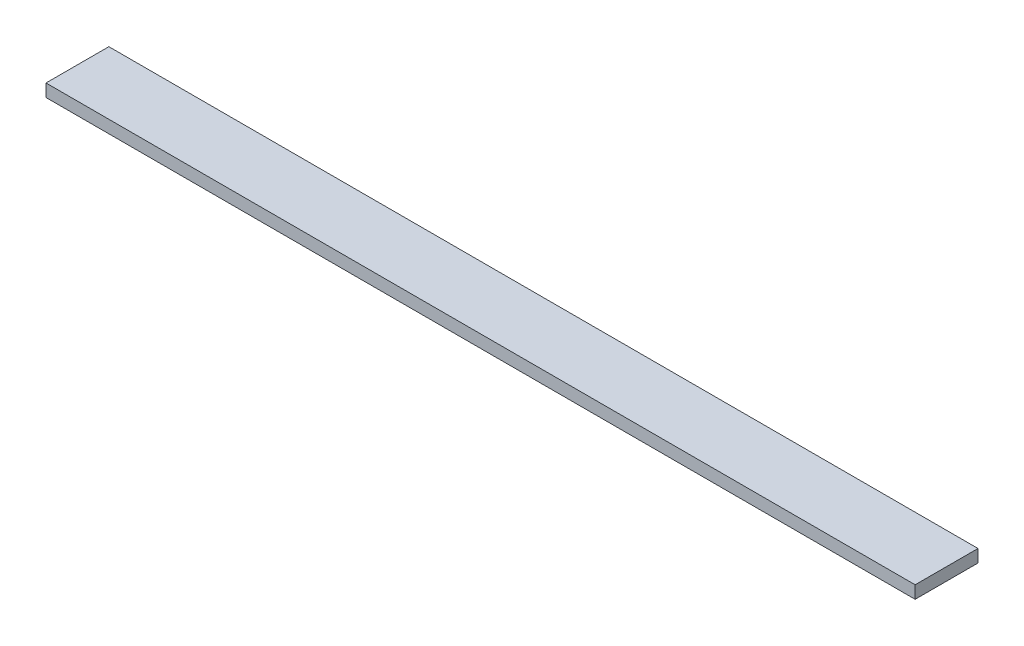
ISO-10303-21;
HEADER;
FILE_DESCRIPTION(('STEP AP214'),'2;1');
FILE_NAME('part.step','',(''),(''),'','','');
FILE_SCHEMA(('AUTOMOTIVE_DESIGN { 1 0 10303 214 1 1 1 1 }'));
ENDSEC;
DATA;
#1=APPLICATION_CONTEXT('core data for automotive mechanical design processes');
#2=APPLICATION_PROTOCOL_DEFINITION('international standard','automotive_design',2000,#1);
#3=PRODUCT_CONTEXT('',#1,'mechanical');
#4=PRODUCT('Part','Part','',(#3));
#5=PRODUCT_RELATED_PRODUCT_CATEGORY('part','',(#4));
#6=PRODUCT_DEFINITION_FORMATION('','',#4);
#7=PRODUCT_DEFINITION_CONTEXT('part definition',#1,'design');
#8=PRODUCT_DEFINITION('design','',#6,#7);
#9=PRODUCT_DEFINITION_SHAPE('','',#8);
#10=(LENGTH_UNIT() NAMED_UNIT(*) SI_UNIT(.MILLI.,.METRE.));
#11=(NAMED_UNIT(*) PLANE_ANGLE_UNIT() SI_UNIT($,.RADIAN.));
#12=(NAMED_UNIT(*) SI_UNIT($,.STERADIAN.) SOLID_ANGLE_UNIT());
#13=UNCERTAINTY_MEASURE_WITH_UNIT(LENGTH_MEASURE(1.E-05),#10,'distance_accuracy_value','');
#14=(GEOMETRIC_REPRESENTATION_CONTEXT(3) GLOBAL_UNCERTAINTY_ASSIGNED_CONTEXT((#13)) GLOBAL_UNIT_ASSIGNED_CONTEXT((#10,
#11,#12)) REPRESENTATION_CONTEXT('',''));
#15=CARTESIAN_POINT('',(0.,0.,0.));
#16=DIRECTION('',(0.,0.,1.));
#17=DIRECTION('',(1.,0.,0.));
#18=AXIS2_PLACEMENT_3D('',#15,#16,#17);
#19=CARTESIAN_POINT('',(0.,2.4765,-12.34));
#20=DIRECTION('',(1.,0.,0.));
#21=DIRECTION('',(0.,0.,-1.));
#22=AXIS2_PLACEMENT_3D('',#19,#20,#21);
#23=PLANE('',#22);
#24=DIRECTION('',(0.,0.,1.));
#25=VECTOR('',#24,1.);
#26=CARTESIAN_POINT('',(0.,-2.4765,-12.34));
#27=LINE('',#26,#25);
#28=CARTESIAN_POINT('',(0.,-2.4765,-12.34));
#29=VERTEX_POINT('',#28);
#30=CARTESIAN_POINT('',(0.,-2.4765,12.34));
#31=VERTEX_POINT('',#30);
#32=EDGE_CURVE('E93',#29,#31,#27,.T.);
#33=ORIENTED_EDGE('',*,*,#32,.T.);
#34=DIRECTION('',(0.,-1.,0.));
#35=VECTOR('',#34,1.);
#36=CARTESIAN_POINT('',(0.,2.4765,12.34));
#37=LINE('',#36,#35);
#38=CARTESIAN_POINT('',(0.,2.4765,12.34));
#39=VERTEX_POINT('',#38);
#40=EDGE_CURVE('E11',#39,#31,#37,.T.);
#41=ORIENTED_EDGE('',*,*,#40,.F.);
#42=DIRECTION('',(0.,0.,1.));
#43=VECTOR('',#42,1.);
#44=CARTESIAN_POINT('',(0.,2.4765,-12.34));
#45=LINE('',#44,#43);
#46=CARTESIAN_POINT('',(0.,2.4765,-12.34));
#47=VERTEX_POINT('',#46);
#48=EDGE_CURVE('E81',#47,#39,#45,.T.);
#49=ORIENTED_EDGE('',*,*,#48,.F.);
#50=DIRECTION('',(0.,-1.,0.));
#51=VECTOR('',#50,1.);
#52=CARTESIAN_POINT('',(0.,2.4765,-12.34));
#53=LINE('',#52,#51);
#54=EDGE_CURVE('E89',#47,#29,#53,.T.);
#55=ORIENTED_EDGE('',*,*,#54,.T.);
#56=EDGE_LOOP('',(#33,#41,#49,#55));
#57=FACE_BOUND('',#56,.T.);
#58=ADVANCED_FACE('F30',(#57),#23,.F.);
#59=CARTESIAN_POINT('',(0.,2.4765,12.34));
#60=DIRECTION('',(0.,0.,-1.));
#61=DIRECTION('',(-1.,0.,0.));
#62=AXIS2_PLACEMENT_3D('',#59,#60,#61);
#63=PLANE('',#62);
#64=DIRECTION('',(1.,0.,0.));
#65=VECTOR('',#64,1.);
#66=CARTESIAN_POINT('',(0.,-2.4765,12.34));
#67=LINE('',#66,#65);
#68=CARTESIAN_POINT('',(341.217,-2.4765,12.34));
#69=VERTEX_POINT('',#68);
#70=EDGE_CURVE('E85',#31,#69,#67,.T.);
#71=ORIENTED_EDGE('',*,*,#70,.T.);
#72=DIRECTION('',(0.,-1.,0.));
#73=VECTOR('',#72,1.);
#74=CARTESIAN_POINT('',(341.217,2.4765,12.34));
#75=LINE('',#74,#73);
#76=CARTESIAN_POINT('',(341.217,2.4765,12.34));
#77=VERTEX_POINT('',#76);
#78=EDGE_CURVE('E38',#77,#69,#75,.T.);
#79=ORIENTED_EDGE('',*,*,#78,.F.);
#80=DIRECTION('',(1.,0.,0.));
#81=VECTOR('',#80,1.);
#82=CARTESIAN_POINT('',(0.,2.4765,12.34));
#83=LINE('',#82,#81);
#84=EDGE_CURVE('E76',#39,#77,#83,.T.);
#85=ORIENTED_EDGE('',*,*,#84,.F.);
#86=ORIENTED_EDGE('',*,*,#40,.T.);
#87=EDGE_LOOP('',(#71,#79,#85,#86));
#88=FACE_BOUND('',#87,.T.);
#89=ADVANCED_FACE('F84',(#88),#63,.F.);
#90=CARTESIAN_POINT('',(341.217,2.4765,-12.34));
#91=DIRECTION('',(-1.,0.,0.));
#92=DIRECTION('',(0.,0.,1.));
#93=AXIS2_PLACEMENT_3D('',#90,#91,#92);
#94=PLANE('',#93);
#95=DIRECTION('',(0.,0.,-1.));
#96=VECTOR('',#95,1.);
#97=CARTESIAN_POINT('',(341.217,-2.4765,-12.34));
#98=LINE('',#97,#96);
#99=CARTESIAN_POINT('',(341.217,-2.4765,-12.34));
#100=VERTEX_POINT('',#99);
#101=EDGE_CURVE('E63',#69,#100,#98,.T.);
#102=ORIENTED_EDGE('',*,*,#101,.T.);
#103=DIRECTION('',(0.,-1.,0.));
#104=VECTOR('',#103,1.);
#105=CARTESIAN_POINT('',(341.217,2.4765,-12.34));
#106=LINE('',#105,#104);
#107=CARTESIAN_POINT('',(341.217,2.4765,-12.34));
#108=VERTEX_POINT('',#107);
#109=EDGE_CURVE('E86',#108,#100,#106,.T.);
#110=ORIENTED_EDGE('',*,*,#109,.F.);
#111=DIRECTION('',(0.,0.,-1.));
#112=VECTOR('',#111,1.);
#113=CARTESIAN_POINT('',(341.217,2.4765,-12.34));
#114=LINE('',#113,#112);
#115=EDGE_CURVE('E79',#77,#108,#114,.T.);
#116=ORIENTED_EDGE('',*,*,#115,.F.);
#117=ORIENTED_EDGE('',*,*,#78,.T.);
#118=EDGE_LOOP('',(#102,#110,#116,#117));
#119=FACE_BOUND('',#118,.T.);
#120=ADVANCED_FACE('F87',(#119),#94,.F.);
#121=CARTESIAN_POINT('',(0.,2.4765,-12.34));
#122=DIRECTION('',(0.,0.,1.));
#123=DIRECTION('',(1.,0.,0.));
#124=AXIS2_PLACEMENT_3D('',#121,#122,#123);
#125=PLANE('',#124);
#126=DIRECTION('',(-1.,0.,0.));
#127=VECTOR('',#126,1.);
#128=CARTESIAN_POINT('',(0.,-2.4765,-12.34));
#129=LINE('',#128,#127);
#130=EDGE_CURVE('E69',#100,#29,#129,.T.);
#131=ORIENTED_EDGE('',*,*,#130,.T.);
#132=ORIENTED_EDGE('',*,*,#54,.F.);
#133=DIRECTION('',(-1.,0.,0.));
#134=VECTOR('',#133,1.);
#135=CARTESIAN_POINT('',(0.,2.4765,-12.34));
#136=LINE('',#135,#134);
#137=EDGE_CURVE('E46',#108,#47,#136,.T.);
#138=ORIENTED_EDGE('',*,*,#137,.F.);
#139=ORIENTED_EDGE('',*,*,#109,.T.);
#140=EDGE_LOOP('',(#131,#132,#138,#139));
#141=FACE_BOUND('',#140,.T.);
#142=ADVANCED_FACE('F100',(#141),#125,.F.);
#143=CARTESIAN_POINT('',(0.,2.4765,12.34));
#144=DIRECTION('',(0.,1.,0.));
#145=DIRECTION('',(0.,0.,1.));
#146=AXIS2_PLACEMENT_3D('',#143,#144,#145);
#147=PLANE('',#146);
#148=ORIENTED_EDGE('',*,*,#48,.T.);
#149=ORIENTED_EDGE('',*,*,#84,.T.);
#150=ORIENTED_EDGE('',*,*,#115,.T.);
#151=ORIENTED_EDGE('',*,*,#137,.T.);
#152=EDGE_LOOP('',(#148,#149,#150,#151));
#153=FACE_BOUND('',#152,.T.);
#154=ADVANCED_FACE('F77',(#153),#147,.T.);
#155=CARTESIAN_POINT('',(0.,-2.4765,12.34));
#156=DIRECTION('',(0.,1.,0.));
#157=DIRECTION('',(0.,0.,1.));
#158=AXIS2_PLACEMENT_3D('',#155,#156,#157);
#159=PLANE('',#158);
#160=ORIENTED_EDGE('',*,*,#32,.F.);
#161=ORIENTED_EDGE('',*,*,#130,.F.);
#162=ORIENTED_EDGE('',*,*,#101,.F.);
#163=ORIENTED_EDGE('',*,*,#70,.F.);
#164=EDGE_LOOP('',(#160,#161,#162,#163));
#165=FACE_BOUND('',#164,.T.);
#166=ADVANCED_FACE('F103',(#165),#159,.F.);
#167=CLOSED_SHELL('',(#58,#89,#120,#142,#154,#166));
#168=MANIFOLD_SOLID_BREP('B2',#167);
#169=ADVANCED_BREP_SHAPE_REPRESENTATION('',(#18,#168),#14);
#170=SHAPE_DEFINITION_REPRESENTATION(#9,#169);
ENDSEC;
END-ISO-10303-21;
